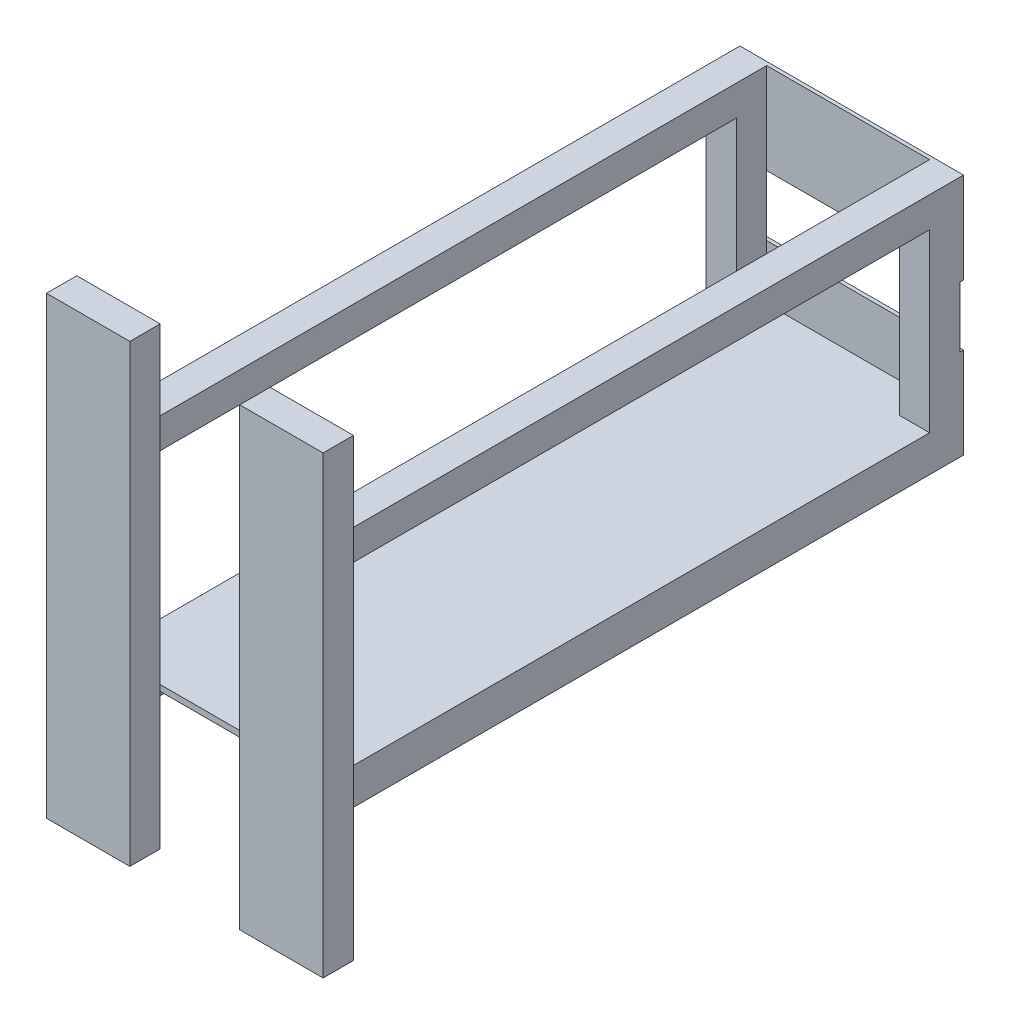
ISO-10303-21;
HEADER;
FILE_DESCRIPTION(('STEP AP214'),'2;1');
FILE_NAME('part.step','',(''),(''),'','','');
FILE_SCHEMA(('AUTOMOTIVE_DESIGN { 1 0 10303 214 1 1 1 1 }'));
ENDSEC;
DATA;
#1=APPLICATION_CONTEXT('core data for automotive mechanical design processes');
#2=APPLICATION_PROTOCOL_DEFINITION('international standard','automotive_design',2000,#1);
#3=PRODUCT_CONTEXT('',#1,'mechanical');
#4=PRODUCT('Part','Part','',(#3));
#5=PRODUCT_RELATED_PRODUCT_CATEGORY('part','',(#4));
#6=PRODUCT_DEFINITION_FORMATION('','',#4);
#7=PRODUCT_DEFINITION_CONTEXT('part definition',#1,'design');
#8=PRODUCT_DEFINITION('design','',#6,#7);
#9=PRODUCT_DEFINITION_SHAPE('','',#8);
#10=(LENGTH_UNIT() NAMED_UNIT(*) SI_UNIT(.MILLI.,.METRE.));
#11=(NAMED_UNIT(*) PLANE_ANGLE_UNIT() SI_UNIT($,.RADIAN.));
#12=(NAMED_UNIT(*) SI_UNIT($,.STERADIAN.) SOLID_ANGLE_UNIT());
#13=UNCERTAINTY_MEASURE_WITH_UNIT(LENGTH_MEASURE(1.E-05),#10,'distance_accuracy_value','');
#14=(GEOMETRIC_REPRESENTATION_CONTEXT(3) GLOBAL_UNCERTAINTY_ASSIGNED_CONTEXT((#13)) GLOBAL_UNIT_ASSIGNED_CONTEXT((#10,
#11,#12)) REPRESENTATION_CONTEXT('',''));
#15=CARTESIAN_POINT('',(0.,0.,0.));
#16=DIRECTION('',(0.,0.,1.));
#17=DIRECTION('',(1.,0.,0.));
#18=AXIS2_PLACEMENT_3D('',#15,#16,#17);
#19=CARTESIAN_POINT('',(0.,0.,6.));
#20=DIRECTION('',(0.,0.,-1.));
#21=DIRECTION('',(-1.,0.,0.));
#22=AXIS2_PLACEMENT_3D('',#19,#20,#21);
#23=PLANE('',#22);
#24=DIRECTION('',(-1.,0.,0.));
#25=VECTOR('',#24,1.);
#26=CARTESIAN_POINT('',(0.,254.,6.));
#27=LINE('',#26,#25);
#28=CARTESIAN_POINT('',(323.85,254.,6.));
#29=VERTEX_POINT('',#28);
#30=CARTESIAN_POINT('',(50.8,254.,6.));
#31=VERTEX_POINT('',#30);
#32=EDGE_CURVE('E401',#29,#31,#27,.T.);
#33=ORIENTED_EDGE('',*,*,#32,.F.);
#34=DIRECTION('',(0.,-1.,0.));
#35=VECTOR('',#34,1.);
#36=CARTESIAN_POINT('',(323.85,0.,6.));
#37=LINE('',#36,#35);
#38=CARTESIAN_POINT('',(323.85,406.4,6.00000000000001));
#39=VERTEX_POINT('',#38);
#40=EDGE_CURVE('E299',#39,#29,#37,.T.);
#41=ORIENTED_EDGE('',*,*,#40,.F.);
#42=DIRECTION('',(1.,0.,0.));
#43=VECTOR('',#42,1.);
#44=CARTESIAN_POINT('',(0.,406.4,6.));
#45=LINE('',#44,#43);
#46=CARTESIAN_POINT('',(50.8,406.4,6.00000000000001));
#47=VERTEX_POINT('',#46);
#48=EDGE_CURVE('E333',#47,#39,#45,.T.);
#49=ORIENTED_EDGE('',*,*,#48,.F.);
#50=DIRECTION('',(0.,-1.,0.));
#51=VECTOR('',#50,1.);
#52=CARTESIAN_POINT('',(50.8000000000001,0.,6.));
#53=LINE('',#52,#51);
#54=EDGE_CURVE('E290',#47,#31,#53,.T.);
#55=ORIENTED_EDGE('',*,*,#54,.T.);
#56=EDGE_LOOP('',(#33,#41,#49,#55));
#57=FACE_BOUND('',#56,.T.);
#58=ADVANCED_FACE('F36',(#57),#23,.F.);
#59=DIRECTION('',(0.,1.,0.));
#60=VECTOR('',#59,1.);
#61=CARTESIAN_POINT('',(323.85,-177.802,6.));
#62=LINE('',#61,#60);
#63=CARTESIAN_POINT('',(323.85,60.8,6.00000000000001));
#64=VERTEX_POINT('',#63);
#65=CARTESIAN_POINT('',(323.85,152.4,6.));
#66=VERTEX_POINT('',#65);
#67=EDGE_CURVE('E277',#64,#66,#62,.T.);
#68=ORIENTED_EDGE('',*,*,#67,.T.);
#69=DIRECTION('',(-1.,0.,0.));
#70=VECTOR('',#69,1.);
#71=CARTESIAN_POINT('',(0.,152.4,6.));
#72=LINE('',#71,#70);
#73=CARTESIAN_POINT('',(50.8,152.4,6.));
#74=VERTEX_POINT('',#73);
#75=EDGE_CURVE('E392',#66,#74,#72,.T.);
#76=ORIENTED_EDGE('',*,*,#75,.T.);
#77=DIRECTION('',(0.,1.,0.));
#78=VECTOR('',#77,1.);
#79=CARTESIAN_POINT('',(50.8,-177.802,6.));
#80=LINE('',#79,#78);
#81=CARTESIAN_POINT('',(50.8,60.8,6.00000000000001));
#82=VERTEX_POINT('',#81);
#83=EDGE_CURVE('E524',#82,#74,#80,.T.);
#84=ORIENTED_EDGE('',*,*,#83,.F.);
#85=DIRECTION('',(-1.,0.,0.));
#86=VECTOR('',#85,1.);
#87=CARTESIAN_POINT('',(0.,60.8,6.00000000000001));
#88=LINE('',#87,#86);
#89=EDGE_CURVE('E412',#64,#82,#88,.T.);
#90=ORIENTED_EDGE('',*,*,#89,.F.);
#91=EDGE_LOOP('',(#68,#76,#84,#90));
#92=FACE_BOUND('',#91,.T.);
#93=ADVANCED_FACE('F617',(#92),#23,.F.);
#94=CARTESIAN_POINT('',(0.,60.8,0.));
#95=DIRECTION('',(0.,1.,0.));
#96=DIRECTION('',(0.,0.,1.));
#97=AXIS2_PLACEMENT_3D('',#94,#95,#96);
#98=PLANE('',#97);
#99=DIRECTION('',(0.,0.,-1.));
#100=VECTOR('',#99,1.);
#101=CARTESIAN_POINT('',(374.65,60.8,6.00000000000001));
#102=LINE('',#101,#100);
#103=CARTESIAN_POINT('',(374.65,60.8,1066.8));
#104=VERTEX_POINT('',#103);
#105=CARTESIAN_POINT('',(374.65,60.8,56.8));
#106=VERTEX_POINT('',#105);
#107=EDGE_CURVE('E409',#104,#106,#102,.T.);
#108=ORIENTED_EDGE('',*,*,#107,.T.);
#109=DIRECTION('',(1.,0.,0.));
#110=VECTOR('',#109,1.);
#111=CARTESIAN_POINT('',(323.85,60.8,56.8));
#112=LINE('',#111,#110);
#113=CARTESIAN_POINT('',(323.85,60.8,56.8));
#114=VERTEX_POINT('',#113);
#115=EDGE_CURVE('E53',#114,#106,#112,.T.);
#116=ORIENTED_EDGE('',*,*,#115,.F.);
#117=DIRECTION('',(0.,0.,1.));
#118=VECTOR('',#117,1.);
#119=CARTESIAN_POINT('',(323.85,60.8,6.));
#120=LINE('',#119,#118);
#121=EDGE_CURVE('E57',#64,#114,#120,.T.);
#122=ORIENTED_EDGE('',*,*,#121,.F.);
#123=ORIENTED_EDGE('',*,*,#89,.T.);
#124=DIRECTION('',(0.,0.,-1.));
#125=VECTOR('',#124,1.);
#126=CARTESIAN_POINT('',(50.8,60.8,56.8));
#127=LINE('',#126,#125);
#128=CARTESIAN_POINT('',(50.8,60.8,56.8));
#129=VERTEX_POINT('',#128);
#130=EDGE_CURVE('E276',#129,#82,#127,.T.);
#131=ORIENTED_EDGE('',*,*,#130,.F.);
#132=DIRECTION('',(1.,0.,0.));
#133=VECTOR('',#132,1.);
#134=CARTESIAN_POINT('',(0.,60.8,56.8));
#135=LINE('',#134,#133);
#136=CARTESIAN_POINT('',(0.,60.8,56.8));
#137=VERTEX_POINT('',#136);
#138=EDGE_CURVE('E525',#137,#129,#135,.T.);
#139=ORIENTED_EDGE('',*,*,#138,.F.);
#140=DIRECTION('',(0.,0.,1.));
#141=VECTOR('',#140,1.);
#142=CARTESIAN_POINT('',(0.,60.8,6.00000000000001));
#143=LINE('',#142,#141);
#144=CARTESIAN_POINT('',(0.,60.8,1066.8));
#145=VERTEX_POINT('',#144);
#146=EDGE_CURVE('E402',#137,#145,#143,.T.);
#147=ORIENTED_EDGE('',*,*,#146,.T.);
#148=DIRECTION('',(1.,0.,0.));
#149=VECTOR('',#148,1.);
#150=CARTESIAN_POINT('',(0.,60.8,1066.8));
#151=LINE('',#150,#149);
#152=CARTESIAN_POINT('',(95.25,60.8,1066.8));
#153=VERTEX_POINT('',#152);
#154=EDGE_CURVE('E406',#145,#153,#151,.T.);
#155=ORIENTED_EDGE('',*,*,#154,.T.);
#156=CARTESIAN_POINT('',(279.4,60.8,1066.8));
#157=VERTEX_POINT('',#156);
#158=EDGE_CURVE('E410',#153,#157,#151,.T.);
#159=ORIENTED_EDGE('',*,*,#158,.T.);
#160=EDGE_CURVE('E404',#157,#104,#151,.T.);
#161=ORIENTED_EDGE('',*,*,#160,.T.);
#162=EDGE_LOOP('',(#108,#116,#122,#123,#131,#139,#147,#155,#159,#161));
#163=FACE_BOUND('',#162,.T.);
#164=ADVANCED_FACE('F547',(#163),#98,.T.);
#165=CARTESIAN_POINT('',(374.65,355.6,1066.8));
#166=DIRECTION('',(0.,-1.,0.));
#167=DIRECTION('',(0.,0.,-1.));
#168=AXIS2_PLACEMENT_3D('',#165,#166,#167);
#169=PLANE('',#168);
#170=DIRECTION('',(0.,0.,-1.));
#171=VECTOR('',#170,1.);
#172=CARTESIAN_POINT('',(323.85,355.6,1066.8));
#173=LINE('',#172,#171);
#174=CARTESIAN_POINT('',(323.85,355.6,1066.8));
#175=VERTEX_POINT('',#174);
#176=CARTESIAN_POINT('',(323.85,355.6,56.8));
#177=VERTEX_POINT('',#176);
#178=EDGE_CURVE('E275',#175,#177,#173,.T.);
#179=ORIENTED_EDGE('',*,*,#178,.T.);
#180=DIRECTION('',(-1.,0.,0.));
#181=VECTOR('',#180,1.);
#182=CARTESIAN_POINT('',(323.85,355.6,56.8));
#183=LINE('',#182,#181);
#184=CARTESIAN_POINT('',(374.65,355.6,56.8));
#185=VERTEX_POINT('',#184);
#186=EDGE_CURVE('E260',#185,#177,#183,.T.);
#187=ORIENTED_EDGE('',*,*,#186,.F.);
#188=DIRECTION('',(0.,0.,-1.));
#189=VECTOR('',#188,1.);
#190=CARTESIAN_POINT('',(374.65,355.6,1066.8));
#191=LINE('',#190,#189);
#192=CARTESIAN_POINT('',(374.65,355.6,1066.8));
#193=VERTEX_POINT('',#192);
#194=EDGE_CURVE('E272',#193,#185,#191,.T.);
#195=ORIENTED_EDGE('',*,*,#194,.F.);
#196=DIRECTION('',(-1.,0.,0.));
#197=VECTOR('',#196,1.);
#198=CARTESIAN_POINT('',(374.65,355.6,1066.8));
#199=LINE('',#198,#197);
#200=EDGE_CURVE('E296',#193,#175,#199,.T.);
#201=ORIENTED_EDGE('',*,*,#200,.T.);
#202=EDGE_LOOP('',(#179,#187,#195,#201));
#203=FACE_BOUND('',#202,.T.);
#204=ADVANCED_FACE('F270',(#203),#169,.T.);
#205=CARTESIAN_POINT('',(0.,355.6,1066.8));
#206=DIRECTION('',(0.,1.,0.));
#207=DIRECTION('',(0.,0.,1.));
#208=AXIS2_PLACEMENT_3D('',#205,#206,#207);
#209=PLANE('',#208);
#210=DIRECTION('',(-1.,0.,0.));
#211=VECTOR('',#210,1.);
#212=CARTESIAN_POINT('',(0.,355.6,56.8));
#213=LINE('',#212,#211);
#214=CARTESIAN_POINT('',(50.8,355.6,56.8));
#215=VERTEX_POINT('',#214);
#216=CARTESIAN_POINT('',(0.,355.6,56.8));
#217=VERTEX_POINT('',#216);
#218=EDGE_CURVE('E380',#215,#217,#213,.T.);
#219=ORIENTED_EDGE('',*,*,#218,.F.);
#220=DIRECTION('',(0.,0.,-1.));
#221=VECTOR('',#220,1.);
#222=CARTESIAN_POINT('',(50.8,355.6,1066.8));
#223=LINE('',#222,#221);
#224=CARTESIAN_POINT('',(50.8,355.6,1066.8));
#225=VERTEX_POINT('',#224);
#226=EDGE_CURVE('E494',#225,#215,#223,.T.);
#227=ORIENTED_EDGE('',*,*,#226,.F.);
#228=DIRECTION('',(1.,0.,0.));
#229=VECTOR('',#228,1.);
#230=CARTESIAN_POINT('',(0.,355.6,1066.8));
#231=LINE('',#230,#229);
#232=CARTESIAN_POINT('',(0.,355.6,1066.8));
#233=VERTEX_POINT('',#232);
#234=EDGE_CURVE('E500',#233,#225,#231,.T.);
#235=ORIENTED_EDGE('',*,*,#234,.F.);
#236=DIRECTION('',(0.,0.,-1.));
#237=VECTOR('',#236,1.);
#238=CARTESIAN_POINT('',(0.,355.6,1066.8));
#239=LINE('',#238,#237);
#240=EDGE_CURVE('E490',#233,#217,#239,.T.);
#241=ORIENTED_EDGE('',*,*,#240,.T.);
#242=EDGE_LOOP('',(#219,#227,#235,#241));
#243=FACE_BOUND('',#242,.T.);
#244=ADVANCED_FACE('F543',(#243),#209,.F.);
#245=CARTESIAN_POINT('',(0.,0.,0.));
#246=DIRECTION('',(0.,0.,-1.));
#247=DIRECTION('',(-1.,0.,0.));
#248=AXIS2_PLACEMENT_3D('',#245,#246,#247);
#249=PLANE('',#248);
#250=DIRECTION('',(0.,1.,0.));
#251=VECTOR('',#250,1.);
#252=CARTESIAN_POINT('',(374.65,0.,0.));
#253=LINE('',#252,#251);
#254=CARTESIAN_POINT('',(374.65,254.,0.));
#255=VERTEX_POINT('',#254);
#256=CARTESIAN_POINT('',(374.65,406.4,0.));
#257=VERTEX_POINT('',#256);
#258=EDGE_CURVE('E345',#255,#257,#253,.T.);
#259=ORIENTED_EDGE('',*,*,#258,.F.);
#260=DIRECTION('',(-1.,0.,0.));
#261=VECTOR('',#260,1.);
#262=CARTESIAN_POINT('',(374.65,254.,0.));
#263=LINE('',#262,#261);
#264=CARTESIAN_POINT('',(0.,254.,0.));
#265=VERTEX_POINT('',#264);
#266=EDGE_CURVE('E370',#255,#265,#263,.T.);
#267=ORIENTED_EDGE('',*,*,#266,.T.);
#268=DIRECTION('',(0.,1.,0.));
#269=VECTOR('',#268,1.);
#270=CARTESIAN_POINT('',(0.,0.,0.));
#271=LINE('',#270,#269);
#272=CARTESIAN_POINT('',(0.,406.4,0.));
#273=VERTEX_POINT('',#272);
#274=EDGE_CURVE('E332',#265,#273,#271,.T.);
#275=ORIENTED_EDGE('',*,*,#274,.T.);
#276=DIRECTION('',(1.,0.,0.));
#277=VECTOR('',#276,1.);
#278=CARTESIAN_POINT('',(0.,406.4,0.));
#279=LINE('',#278,#277);
#280=EDGE_CURVE('E342',#273,#257,#279,.T.);
#281=ORIENTED_EDGE('',*,*,#280,.T.);
#282=EDGE_LOOP('',(#259,#267,#275,#281));
#283=FACE_BOUND('',#282,.T.);
#284=ADVANCED_FACE('F368',(#283),#249,.T.);
#285=DIRECTION('',(-1.,0.,0.));
#286=VECTOR('',#285,1.);
#287=CARTESIAN_POINT('',(0.,50.8,6.00000000000001));
#288=LINE('',#287,#286);
#289=CARTESIAN_POINT('',(323.85,50.8,6.));
#290=VERTEX_POINT('',#289);
#291=CARTESIAN_POINT('',(50.8,50.8,6.));
#292=VERTEX_POINT('',#291);
#293=EDGE_CURVE('E405',#290,#292,#288,.T.);
#294=ORIENTED_EDGE('',*,*,#293,.T.);
#295=DIRECTION('',(0.,1.,0.));
#296=VECTOR('',#295,1.);
#297=CARTESIAN_POINT('',(50.8,0.,6.));
#298=LINE('',#297,#296);
#299=CARTESIAN_POINT('',(50.8,0.,6.00000000000001));
#300=VERTEX_POINT('',#299);
#301=EDGE_CURVE('E327',#300,#292,#298,.T.);
#302=ORIENTED_EDGE('',*,*,#301,.F.);
#303=DIRECTION('',(1.,0.,0.));
#304=VECTOR('',#303,1.);
#305=CARTESIAN_POINT('',(0.,0.,6.));
#306=LINE('',#305,#304);
#307=CARTESIAN_POINT('',(323.85,0.,6.00000000000001));
#308=VERTEX_POINT('',#307);
#309=EDGE_CURVE('E335',#300,#308,#306,.T.);
#310=ORIENTED_EDGE('',*,*,#309,.T.);
#311=DIRECTION('',(0.,1.,0.));
#312=VECTOR('',#311,1.);
#313=CARTESIAN_POINT('',(323.85,0.,6.));
#314=LINE('',#313,#312);
#315=EDGE_CURVE('E314',#308,#290,#314,.T.);
#316=ORIENTED_EDGE('',*,*,#315,.T.);
#317=EDGE_LOOP('',(#294,#302,#310,#316));
#318=FACE_BOUND('',#317,.T.);
#319=ADVANCED_FACE('F554',(#318),#23,.F.);
#320=CARTESIAN_POINT('',(0.,0.,1066.8));
#321=DIRECTION('',(0.,0.,1.));
#322=DIRECTION('',(1.,0.,0.));
#323=AXIS2_PLACEMENT_3D('',#320,#321,#322);
#324=PLANE('',#323);
#325=DIRECTION('',(0.,-1.,0.));
#326=VECTOR('',#325,1.);
#327=CARTESIAN_POINT('',(0.,406.4,1066.8));
#328=LINE('',#327,#326);
#329=CARTESIAN_POINT('',(0.,406.4,1066.8));
#330=VERTEX_POINT('',#329);
#331=EDGE_CURVE('E363',#330,#233,#328,.T.);
#332=ORIENTED_EDGE('',*,*,#331,.T.);
#333=ORIENTED_EDGE('',*,*,#234,.T.);
#334=DIRECTION('',(0.,-1.,0.));
#335=VECTOR('',#334,1.);
#336=CARTESIAN_POINT('',(50.8,406.4,1066.8));
#337=LINE('',#336,#335);
#338=CARTESIAN_POINT('',(50.8,406.4,1066.8));
#339=VERTEX_POINT('',#338);
#340=EDGE_CURVE('E502',#339,#225,#337,.T.);
#341=ORIENTED_EDGE('',*,*,#340,.F.);
#342=DIRECTION('',(1.,0.,0.));
#343=VECTOR('',#342,1.);
#344=CARTESIAN_POINT('',(0.,406.4,1066.8));
#345=LINE('',#344,#343);
#346=EDGE_CURVE('E504',#330,#339,#345,.T.);
#347=ORIENTED_EDGE('',*,*,#346,.F.);
#348=EDGE_LOOP('',(#332,#333,#341,#347));
#349=FACE_BOUND('',#348,.T.);
#350=ORIENTED_EDGE('',*,*,#154,.F.);
#351=DIRECTION('',(0.,1.,0.));
#352=VECTOR('',#351,1.);
#353=CARTESIAN_POINT('',(0.,0.,1066.8));
#354=LINE('',#353,#352);
#355=CARTESIAN_POINT('',(0.,0.,1066.8));
#356=VERTEX_POINT('',#355);
#357=EDGE_CURVE('E317',#356,#145,#354,.T.);
#358=ORIENTED_EDGE('',*,*,#357,.F.);
#359=DIRECTION('',(1.,0.,0.));
#360=VECTOR('',#359,1.);
#361=CARTESIAN_POINT('',(0.,0.,1066.8));
#362=LINE('',#361,#360);
#363=CARTESIAN_POINT('',(50.8,0.,1066.8));
#364=VERTEX_POINT('',#363);
#365=EDGE_CURVE('E322',#356,#364,#362,.T.);
#366=ORIENTED_EDGE('',*,*,#365,.T.);
#367=DIRECTION('',(0.,1.,0.));
#368=VECTOR('',#367,1.);
#369=CARTESIAN_POINT('',(50.8,0.,1066.8));
#370=LINE('',#369,#368);
#371=CARTESIAN_POINT('',(50.8,50.8,1066.8));
#372=VERTEX_POINT('',#371);
#373=EDGE_CURVE('E320',#364,#372,#370,.T.);
#374=ORIENTED_EDGE('',*,*,#373,.T.);
#375=DIRECTION('',(1.,0.,0.));
#376=VECTOR('',#375,1.);
#377=CARTESIAN_POINT('',(0.,50.8,1066.8));
#378=LINE('',#377,#376);
#379=CARTESIAN_POINT('',(95.25,50.8,1066.8));
#380=VERTEX_POINT('',#379);
#381=EDGE_CURVE('E417',#372,#380,#378,.T.);
#382=ORIENTED_EDGE('',*,*,#381,.T.);
#383=DIRECTION('',(0.,1.,0.));
#384=VECTOR('',#383,1.);
#385=CARTESIAN_POINT('',(95.25,-177.8,1066.8));
#386=LINE('',#385,#384);
#387=CARTESIAN_POINT('',(95.25,-177.8,1066.8));
#388=VERTEX_POINT('',#387);
#389=EDGE_CURVE('E473',#388,#380,#386,.T.);
#390=ORIENTED_EDGE('',*,*,#389,.F.);
#391=DIRECTION('',(1.,0.,0.));
#392=VECTOR('',#391,1.);
#393=CARTESIAN_POINT('',(-44.45,-177.8,1066.8));
#394=LINE('',#393,#392);
#395=CARTESIAN_POINT('',(-44.45,-177.8,1066.8));
#396=VERTEX_POINT('',#395);
#397=EDGE_CURVE('E446',#396,#388,#394,.T.);
#398=ORIENTED_EDGE('',*,*,#397,.F.);
#399=DIRECTION('',(0.,1.,0.));
#400=VECTOR('',#399,1.);
#401=CARTESIAN_POINT('',(-44.45,-177.8,1066.8));
#402=LINE('',#401,#400);
#403=CARTESIAN_POINT('',(-44.45,584.2,1066.8));
#404=VERTEX_POINT('',#403);
#405=EDGE_CURVE('E461',#396,#404,#402,.T.);
#406=ORIENTED_EDGE('',*,*,#405,.T.);
#407=DIRECTION('',(1.,0.,0.));
#408=VECTOR('',#407,1.);
#409=CARTESIAN_POINT('',(-44.45,584.2,1066.8));
#410=LINE('',#409,#408);
#411=CARTESIAN_POINT('',(95.25,584.2,1066.8));
#412=VERTEX_POINT('',#411);
#413=EDGE_CURVE('E476',#404,#412,#410,.T.);
#414=ORIENTED_EDGE('',*,*,#413,.T.);
#415=EDGE_CURVE('E472',#153,#412,#386,.T.);
#416=ORIENTED_EDGE('',*,*,#415,.F.);
#417=EDGE_LOOP('',(#350,#358,#366,#374,#382,#390,#398,#406,#414,#416));
#418=FACE_BOUND('',#417,.T.);
#419=ADVANCED_FACE('F550',(#349,#418),#324,.F.);
#420=CARTESIAN_POINT('',(0.,0.,1066.8));
#421=DIRECTION('',(0.,0.,1.));
#422=DIRECTION('',(1.,0.,0.));
#423=AXIS2_PLACEMENT_3D('',#420,#421,#422);
#424=PLANE('',#423);
#425=ORIENTED_EDGE('',*,*,#200,.F.);
#426=DIRECTION('',(0.,-1.,0.));
#427=VECTOR('',#426,1.);
#428=CARTESIAN_POINT('',(374.65,406.4,1066.8));
#429=LINE('',#428,#427);
#430=CARTESIAN_POINT('',(374.65,406.4,1066.8));
#431=VERTEX_POINT('',#430);
#432=EDGE_CURVE('E282',#431,#193,#429,.T.);
#433=ORIENTED_EDGE('',*,*,#432,.F.);
#434=DIRECTION('',(-1.,0.,0.));
#435=VECTOR('',#434,1.);
#436=CARTESIAN_POINT('',(374.65,406.4,1066.8));
#437=LINE('',#436,#435);
#438=CARTESIAN_POINT('',(323.85,406.4,1066.8));
#439=VERTEX_POINT('',#438);
#440=EDGE_CURVE('E283',#431,#439,#437,.T.);
#441=ORIENTED_EDGE('',*,*,#440,.T.);
#442=DIRECTION('',(0.,-1.,0.));
#443=VECTOR('',#442,1.);
#444=CARTESIAN_POINT('',(323.85,406.4,1066.8));
#445=LINE('',#444,#443);
#446=EDGE_CURVE('E285',#439,#175,#445,.T.);
#447=ORIENTED_EDGE('',*,*,#446,.T.);
#448=EDGE_LOOP('',(#425,#433,#441,#447));
#449=FACE_BOUND('',#448,.T.);
#450=DIRECTION('',(0.,1.,0.));
#451=VECTOR('',#450,1.);
#452=CARTESIAN_POINT('',(374.65,0.,1066.8));
#453=LINE('',#452,#451);
#454=CARTESIAN_POINT('',(374.65,0.,1066.8));
#455=VERTEX_POINT('',#454);
#456=EDGE_CURVE('E305',#455,#104,#453,.T.);
#457=ORIENTED_EDGE('',*,*,#456,.T.);
#458=ORIENTED_EDGE('',*,*,#160,.F.);
#459=DIRECTION('',(0.,1.,0.));
#460=VECTOR('',#459,1.);
#461=CARTESIAN_POINT('',(279.4,-177.8,1066.8));
#462=LINE('',#461,#460);
#463=CARTESIAN_POINT('',(279.4,584.2,1066.8));
#464=VERTEX_POINT('',#463);
#465=EDGE_CURVE('E437',#157,#464,#462,.T.);
#466=ORIENTED_EDGE('',*,*,#465,.T.);
#467=DIRECTION('',(1.,0.,0.));
#468=VECTOR('',#467,1.);
#469=CARTESIAN_POINT('',(279.4,584.2,1066.8));
#470=LINE('',#469,#468);
#471=CARTESIAN_POINT('',(419.1,584.2,1066.8));
#472=VERTEX_POINT('',#471);
#473=EDGE_CURVE('E435',#464,#472,#470,.T.);
#474=ORIENTED_EDGE('',*,*,#473,.T.);
#475=DIRECTION('',(0.,1.,0.));
#476=VECTOR('',#475,1.);
#477=CARTESIAN_POINT('',(419.1,-177.8,1066.8));
#478=LINE('',#477,#476);
#479=CARTESIAN_POINT('',(419.1,-177.8,1066.8));
#480=VERTEX_POINT('',#479);
#481=EDGE_CURVE('E440',#480,#472,#478,.T.);
#482=ORIENTED_EDGE('',*,*,#481,.F.);
#483=DIRECTION('',(1.,0.,0.));
#484=VECTOR('',#483,1.);
#485=CARTESIAN_POINT('',(279.4,-177.8,1066.8));
#486=LINE('',#485,#484);
#487=CARTESIAN_POINT('',(279.4,-177.8,1066.8));
#488=VERTEX_POINT('',#487);
#489=EDGE_CURVE('E443',#488,#480,#486,.T.);
#490=ORIENTED_EDGE('',*,*,#489,.F.);
#491=CARTESIAN_POINT('',(279.4,50.8,1066.8));
#492=VERTEX_POINT('',#491);
#493=EDGE_CURVE('E432',#488,#492,#462,.T.);
#494=ORIENTED_EDGE('',*,*,#493,.T.);
#495=CARTESIAN_POINT('',(323.85,50.8,1066.8));
#496=VERTEX_POINT('',#495);
#497=EDGE_CURVE('E400',#492,#496,#378,.T.);
#498=ORIENTED_EDGE('',*,*,#497,.T.);
#499=DIRECTION('',(0.,1.,0.));
#500=VECTOR('',#499,1.);
#501=CARTESIAN_POINT('',(323.85,0.,1066.8));
#502=LINE('',#501,#500);
#503=CARTESIAN_POINT('',(323.85,0.,1066.8));
#504=VERTEX_POINT('',#503);
#505=EDGE_CURVE('E308',#504,#496,#502,.T.);
#506=ORIENTED_EDGE('',*,*,#505,.F.);
#507=DIRECTION('',(-1.,0.,0.));
#508=VECTOR('',#507,1.);
#509=CARTESIAN_POINT('',(374.65,0.,1066.8));
#510=LINE('',#509,#508);
#511=EDGE_CURVE('E311',#455,#504,#510,.T.);
#512=ORIENTED_EDGE('',*,*,#511,.F.);
#513=EDGE_LOOP('',(#457,#458,#466,#474,#482,#490,#494,#498,#506,#512));
#514=FACE_BOUND('',#513,.T.);
#515=ADVANCED_FACE('F553',(#449,#514),#424,.F.);
#516=CARTESIAN_POINT('',(0.,0.,6.));
#517=DIRECTION('',(-1.,0.,0.));
#518=DIRECTION('',(0.,0.,1.));
#519=AXIS2_PLACEMENT_3D('',#516,#517,#518);
#520=PLANE('',#519);
#521=DIRECTION('',(0.,1.,0.));
#522=VECTOR('',#521,1.);
#523=CARTESIAN_POINT('',(0.,-177.802,6.00000000000001));
#524=LINE('',#523,#522);
#525=CARTESIAN_POINT('',(0.,152.4,6.00000000000001));
#526=VERTEX_POINT('',#525);
#527=CARTESIAN_POINT('',(0.,254.,6.));
#528=VERTEX_POINT('',#527);
#529=EDGE_CURVE('E520',#526,#528,#524,.T.);
#530=ORIENTED_EDGE('',*,*,#529,.F.);
#531=DIRECTION('',(0.,0.,-1.));
#532=VECTOR('',#531,1.);
#533=CARTESIAN_POINT('',(0.,152.4,10.));
#534=LINE('',#533,#532);
#535=CARTESIAN_POINT('',(0.,152.4,0.));
#536=VERTEX_POINT('',#535);
#537=EDGE_CURVE('E385',#526,#536,#534,.T.);
#538=ORIENTED_EDGE('',*,*,#537,.T.);
#539=CARTESIAN_POINT('',(0.,0.,0.));
#540=VERTEX_POINT('',#539);
#541=EDGE_CURVE('E339',#540,#536,#271,.T.);
#542=ORIENTED_EDGE('',*,*,#541,.F.);
#543=DIRECTION('',(0.,0.,-1.));
#544=VECTOR('',#543,1.);
#545=CARTESIAN_POINT('',(0.,0.,6.));
#546=LINE('',#545,#544);
#547=EDGE_CURVE('E11',#356,#540,#546,.T.);
#548=ORIENTED_EDGE('',*,*,#547,.F.);
#549=ORIENTED_EDGE('',*,*,#357,.T.);
#550=ORIENTED_EDGE('',*,*,#146,.F.);
#551=DIRECTION('',(0.,1.,0.));
#552=VECTOR('',#551,1.);
#553=CARTESIAN_POINT('',(0.,-177.802,56.8));
#554=LINE('',#553,#552);
#555=EDGE_CURVE('E533',#137,#217,#554,.T.);
#556=ORIENTED_EDGE('',*,*,#555,.T.);
#557=ORIENTED_EDGE('',*,*,#240,.F.);
#558=ORIENTED_EDGE('',*,*,#331,.F.);
#559=DIRECTION('',(0.,0.,-1.));
#560=VECTOR('',#559,1.);
#561=CARTESIAN_POINT('',(0.,406.4,6.));
#562=LINE('',#561,#560);
#563=EDGE_CURVE('E40',#330,#273,#562,.T.);
#564=ORIENTED_EDGE('',*,*,#563,.T.);
#565=ORIENTED_EDGE('',*,*,#274,.F.);
#566=DIRECTION('',(0.,0.,-1.));
#567=VECTOR('',#566,1.);
#568=CARTESIAN_POINT('',(0.,254.,10.));
#569=LINE('',#568,#567);
#570=EDGE_CURVE('E388',#528,#265,#569,.T.);
#571=ORIENTED_EDGE('',*,*,#570,.F.);
#572=EDGE_LOOP('',(#530,#538,#542,#548,#549,#550,#556,#557,#558,#564,#565,#571));
#573=FACE_BOUND('',#572,.T.);
#574=ADVANCED_FACE('F38',(#573),#520,.T.);
#575=CARTESIAN_POINT('',(0.,0.,6.));
#576=DIRECTION('',(0.,1.,0.));
#577=DIRECTION('',(0.,0.,1.));
#578=AXIS2_PLACEMENT_3D('',#575,#576,#577);
#579=PLANE('',#578);
#580=DIRECTION('',(1.,0.,0.));
#581=VECTOR('',#580,1.);
#582=CARTESIAN_POINT('',(0.,0.,0.));
#583=LINE('',#582,#581);
#584=CARTESIAN_POINT('',(374.65,0.,0.));
#585=VERTEX_POINT('',#584);
#586=EDGE_CURVE('E336',#540,#585,#583,.T.);
#587=ORIENTED_EDGE('',*,*,#586,.T.);
#588=DIRECTION('',(0.,0.,-1.));
#589=VECTOR('',#588,1.);
#590=CARTESIAN_POINT('',(374.65,0.,6.));
#591=LINE('',#590,#589);
#592=EDGE_CURVE('E45',#455,#585,#591,.T.);
#593=ORIENTED_EDGE('',*,*,#592,.F.);
#594=ORIENTED_EDGE('',*,*,#511,.T.);
#595=DIRECTION('',(0.,0.,-1.));
#596=VECTOR('',#595,1.);
#597=CARTESIAN_POINT('',(323.85,0.,1066.8));
#598=LINE('',#597,#596);
#599=EDGE_CURVE('E302',#504,#308,#598,.T.);
#600=ORIENTED_EDGE('',*,*,#599,.T.);
#601=ORIENTED_EDGE('',*,*,#309,.F.);
#602=DIRECTION('',(0.,0.,-1.));
#603=VECTOR('',#602,1.);
#604=CARTESIAN_POINT('',(50.8,0.,1066.8));
#605=LINE('',#604,#603);
#606=EDGE_CURVE('E325',#364,#300,#605,.T.);
#607=ORIENTED_EDGE('',*,*,#606,.F.);
#608=ORIENTED_EDGE('',*,*,#365,.F.);
#609=ORIENTED_EDGE('',*,*,#547,.T.);
#610=EDGE_LOOP('',(#587,#593,#594,#600,#601,#607,#608,#609));
#611=FACE_BOUND('',#610,.T.);
#612=ADVANCED_FACE('F575',(#611),#579,.F.);
#613=CARTESIAN_POINT('',(374.65,0.,6.));
#614=DIRECTION('',(-1.,0.,0.));
#615=DIRECTION('',(0.,0.,1.));
#616=AXIS2_PLACEMENT_3D('',#613,#614,#615);
#617=PLANE('',#616);
#618=CARTESIAN_POINT('',(374.65,152.4,0.));
#619=VERTEX_POINT('',#618);
#620=EDGE_CURVE('E346',#585,#619,#253,.T.);
#621=ORIENTED_EDGE('',*,*,#620,.T.);
#622=DIRECTION('',(0.,0.,-1.));
#623=VECTOR('',#622,1.);
#624=CARTESIAN_POINT('',(374.65,152.4,10.));
#625=LINE('',#624,#623);
#626=CARTESIAN_POINT('',(374.65,152.4,6.));
#627=VERTEX_POINT('',#626);
#628=EDGE_CURVE('E377',#627,#619,#625,.T.);
#629=ORIENTED_EDGE('',*,*,#628,.F.);
#630=DIRECTION('',(0.,1.,0.));
#631=VECTOR('',#630,1.);
#632=CARTESIAN_POINT('',(374.65,-177.802,6.00000000000001));
#633=LINE('',#632,#631);
#634=CARTESIAN_POINT('',(374.65,254.,6.00000000000001));
#635=VERTEX_POINT('',#634);
#636=EDGE_CURVE('E266',#627,#635,#633,.T.);
#637=ORIENTED_EDGE('',*,*,#636,.T.);
#638=DIRECTION('',(0.,0.,-1.));
#639=VECTOR('',#638,1.);
#640=CARTESIAN_POINT('',(374.65,254.,10.));
#641=LINE('',#640,#639);
#642=EDGE_CURVE('E390',#635,#255,#641,.T.);
#643=ORIENTED_EDGE('',*,*,#642,.T.);
#644=ORIENTED_EDGE('',*,*,#258,.T.);
#645=DIRECTION('',(0.,0.,-1.));
#646=VECTOR('',#645,1.);
#647=CARTESIAN_POINT('',(374.65,406.4,6.));
#648=LINE('',#647,#646);
#649=EDGE_CURVE('E350',#431,#257,#648,.T.);
#650=ORIENTED_EDGE('',*,*,#649,.F.);
#651=ORIENTED_EDGE('',*,*,#432,.T.);
#652=ORIENTED_EDGE('',*,*,#194,.T.);
#653=DIRECTION('',(0.,1.,0.));
#654=VECTOR('',#653,1.);
#655=CARTESIAN_POINT('',(374.65,-177.802,56.8));
#656=LINE('',#655,#654);
#657=EDGE_CURVE('E256',#106,#185,#656,.T.);
#658=ORIENTED_EDGE('',*,*,#657,.F.);
#659=ORIENTED_EDGE('',*,*,#107,.F.);
#660=ORIENTED_EDGE('',*,*,#456,.F.);
#661=ORIENTED_EDGE('',*,*,#592,.T.);
#662=EDGE_LOOP('',(#621,#629,#637,#643,#644,#650,#651,#652,#658,#659,#660,#661));
#663=FACE_BOUND('',#662,.T.);
#664=ADVANCED_FACE('F280',(#663),#617,.F.);
#665=CARTESIAN_POINT('',(0.,406.4,6.));
#666=DIRECTION('',(0.,1.,0.));
#667=DIRECTION('',(0.,0.,1.));
#668=AXIS2_PLACEMENT_3D('',#665,#666,#667);
#669=PLANE('',#668);
#670=ORIENTED_EDGE('',*,*,#649,.T.);
#671=ORIENTED_EDGE('',*,*,#280,.F.);
#672=ORIENTED_EDGE('',*,*,#563,.F.);
#673=ORIENTED_EDGE('',*,*,#346,.T.);
#674=DIRECTION('',(0.,0.,-1.));
#675=VECTOR('',#674,1.);
#676=CARTESIAN_POINT('',(50.8,406.4,1066.8));
#677=LINE('',#676,#675);
#678=EDGE_CURVE('E491',#339,#47,#677,.T.);
#679=ORIENTED_EDGE('',*,*,#678,.T.);
#680=ORIENTED_EDGE('',*,*,#48,.T.);
#681=DIRECTION('',(0.,0.,-1.));
#682=VECTOR('',#681,1.);
#683=CARTESIAN_POINT('',(323.85,406.4,1066.8));
#684=LINE('',#683,#682);
#685=EDGE_CURVE('E287',#439,#39,#684,.T.);
#686=ORIENTED_EDGE('',*,*,#685,.F.);
#687=ORIENTED_EDGE('',*,*,#440,.F.);
#688=EDGE_LOOP('',(#670,#671,#672,#673,#679,#680,#686,#687));
#689=FACE_BOUND('',#688,.T.);
#690=ADVANCED_FACE('F365',(#689),#669,.T.);
#691=DIRECTION('',(-1.,0.,0.));
#692=VECTOR('',#691,1.);
#693=CARTESIAN_POINT('',(374.65,152.4,0.));
#694=LINE('',#693,#692);
#695=EDGE_CURVE('E374',#619,#536,#694,.T.);
#696=ORIENTED_EDGE('',*,*,#695,.F.);
#697=ORIENTED_EDGE('',*,*,#620,.F.);
#698=ORIENTED_EDGE('',*,*,#586,.F.);
#699=ORIENTED_EDGE('',*,*,#541,.T.);
#700=EDGE_LOOP('',(#696,#697,#698,#699));
#701=FACE_BOUND('',#700,.T.);
#702=ADVANCED_FACE('F581',(#701),#249,.T.);
#703=CARTESIAN_POINT('',(50.8,0.,1066.8));
#704=DIRECTION('',(-1.,0.,0.));
#705=DIRECTION('',(0.,0.,1.));
#706=AXIS2_PLACEMENT_3D('',#703,#704,#705);
#707=PLANE('',#706);
#708=ORIENTED_EDGE('',*,*,#606,.T.);
#709=ORIENTED_EDGE('',*,*,#301,.T.);
#710=DIRECTION('',(0.,0.,-1.));
#711=VECTOR('',#710,1.);
#712=CARTESIAN_POINT('',(50.8,50.8,1066.8));
#713=LINE('',#712,#711);
#714=EDGE_CURVE('E324',#372,#292,#713,.T.);
#715=ORIENTED_EDGE('',*,*,#714,.F.);
#716=ORIENTED_EDGE('',*,*,#373,.F.);
#717=EDGE_LOOP('',(#708,#709,#715,#716));
#718=FACE_BOUND('',#717,.T.);
#719=ADVANCED_FACE('F636',(#718),#707,.F.);
#720=CARTESIAN_POINT('',(323.85,0.,1066.8));
#721=DIRECTION('',(-1.,0.,0.));
#722=DIRECTION('',(0.,0.,1.));
#723=AXIS2_PLACEMENT_3D('',#720,#721,#722);
#724=PLANE('',#723);
#725=ORIENTED_EDGE('',*,*,#315,.F.);
#726=ORIENTED_EDGE('',*,*,#599,.F.);
#727=ORIENTED_EDGE('',*,*,#505,.T.);
#728=DIRECTION('',(0.,0.,-1.));
#729=VECTOR('',#728,1.);
#730=CARTESIAN_POINT('',(323.85,50.8,1066.8));
#731=LINE('',#730,#729);
#732=EDGE_CURVE('E301',#496,#290,#731,.T.);
#733=ORIENTED_EDGE('',*,*,#732,.T.);
#734=EDGE_LOOP('',(#725,#726,#727,#733));
#735=FACE_BOUND('',#734,.T.);
#736=ADVANCED_FACE('F644',(#735),#724,.T.);
#737=CARTESIAN_POINT('',(323.85,406.4,1066.8));
#738=DIRECTION('',(1.,0.,0.));
#739=DIRECTION('',(0.,0.,-1.));
#740=AXIS2_PLACEMENT_3D('',#737,#738,#739);
#741=PLANE('',#740);
#742=ORIENTED_EDGE('',*,*,#685,.T.);
#743=ORIENTED_EDGE('',*,*,#40,.T.);
#744=EDGE_CURVE('E596',#66,#29,#62,.T.);
#745=ORIENTED_EDGE('',*,*,#744,.F.);
#746=ORIENTED_EDGE('',*,*,#67,.F.);
#747=ORIENTED_EDGE('',*,*,#121,.T.);
#748=DIRECTION('',(0.,1.,0.));
#749=VECTOR('',#748,1.);
#750=CARTESIAN_POINT('',(323.85,-177.802,56.8));
#751=LINE('',#750,#749);
#752=EDGE_CURVE('E265',#114,#177,#751,.T.);
#753=ORIENTED_EDGE('',*,*,#752,.T.);
#754=ORIENTED_EDGE('',*,*,#178,.F.);
#755=ORIENTED_EDGE('',*,*,#446,.F.);
#756=EDGE_LOOP('',(#742,#743,#745,#746,#747,#753,#754,#755));
#757=FACE_BOUND('',#756,.T.);
#758=ADVANCED_FACE('F602',(#757),#741,.F.);
#759=CARTESIAN_POINT('',(50.8,406.4,1066.8));
#760=DIRECTION('',(1.,0.,0.));
#761=DIRECTION('',(0.,1.,0.));
#762=AXIS2_PLACEMENT_3D('',#759,#760,#761);
#763=PLANE('',#762);
#764=ORIENTED_EDGE('',*,*,#54,.F.);
#765=ORIENTED_EDGE('',*,*,#678,.F.);
#766=ORIENTED_EDGE('',*,*,#340,.T.);
#767=ORIENTED_EDGE('',*,*,#226,.T.);
#768=DIRECTION('',(0.,1.,0.));
#769=VECTOR('',#768,1.);
#770=CARTESIAN_POINT('',(50.8,-177.802,56.8));
#771=LINE('',#770,#769);
#772=EDGE_CURVE('E527',#129,#215,#771,.T.);
#773=ORIENTED_EDGE('',*,*,#772,.F.);
#774=ORIENTED_EDGE('',*,*,#130,.T.);
#775=ORIENTED_EDGE('',*,*,#83,.T.);
#776=EDGE_CURVE('E518',#74,#31,#80,.T.);
#777=ORIENTED_EDGE('',*,*,#776,.T.);
#778=EDGE_LOOP('',(#764,#765,#766,#767,#773,#774,#775,#777));
#779=FACE_BOUND('',#778,.T.);
#780=ADVANCED_FACE('F521',(#779),#763,.T.);
#781=CARTESIAN_POINT('',(-44.45,-177.8,1117.6));
#782=DIRECTION('',(0.,1.,0.));
#783=DIRECTION('',(0.,0.,1.));
#784=AXIS2_PLACEMENT_3D('',#781,#782,#783);
#785=PLANE('',#784);
#786=ORIENTED_EDGE('',*,*,#397,.T.);
#787=DIRECTION('',(0.,0.,-1.));
#788=VECTOR('',#787,1.);
#789=CARTESIAN_POINT('',(95.25,-177.8,1117.6));
#790=LINE('',#789,#788);
#791=CARTESIAN_POINT('',(95.25,-177.8,1117.6));
#792=VERTEX_POINT('',#791);
#793=EDGE_CURVE('E487',#792,#388,#790,.T.);
#794=ORIENTED_EDGE('',*,*,#793,.F.);
#795=DIRECTION('',(1.,0.,0.));
#796=VECTOR('',#795,1.);
#797=CARTESIAN_POINT('',(-44.45,-177.8,1117.6));
#798=LINE('',#797,#796);
#799=CARTESIAN_POINT('',(-44.45,-177.8,1117.6));
#800=VERTEX_POINT('',#799);
#801=EDGE_CURVE('E457',#800,#792,#798,.T.);
#802=ORIENTED_EDGE('',*,*,#801,.F.);
#803=DIRECTION('',(0.,0.,-1.));
#804=VECTOR('',#803,1.);
#805=CARTESIAN_POINT('',(-44.45,-177.8,1117.6));
#806=LINE('',#805,#804);
#807=EDGE_CURVE('E469',#800,#396,#806,.T.);
#808=ORIENTED_EDGE('',*,*,#807,.T.);
#809=EDGE_LOOP('',(#786,#794,#802,#808));
#810=FACE_BOUND('',#809,.T.);
#811=ADVANCED_FACE('F687',(#810),#785,.F.);
#812=CARTESIAN_POINT('',(95.25,-177.8,1117.6));
#813=DIRECTION('',(-1.,0.,0.));
#814=DIRECTION('',(0.,0.,1.));
#815=AXIS2_PLACEMENT_3D('',#812,#813,#814);
#816=PLANE('',#815);
#817=ORIENTED_EDGE('',*,*,#389,.T.);
#818=DIRECTION('',(0.,-1.,0.));
#819=VECTOR('',#818,1.);
#820=CARTESIAN_POINT('',(95.25,-177.8,1066.8));
#821=LINE('',#820,#819);
#822=EDGE_CURVE('E414',#153,#380,#821,.T.);
#823=ORIENTED_EDGE('',*,*,#822,.F.);
#824=ORIENTED_EDGE('',*,*,#415,.T.);
#825=DIRECTION('',(0.,0.,-1.));
#826=VECTOR('',#825,1.);
#827=CARTESIAN_POINT('',(95.25,584.2,1117.6));
#828=LINE('',#827,#826);
#829=CARTESIAN_POINT('',(95.25,584.2,1117.6));
#830=VERTEX_POINT('',#829);
#831=EDGE_CURVE('E484',#830,#412,#828,.T.);
#832=ORIENTED_EDGE('',*,*,#831,.F.);
#833=DIRECTION('',(0.,1.,0.));
#834=VECTOR('',#833,1.);
#835=CARTESIAN_POINT('',(95.25,-177.8,1117.6));
#836=LINE('',#835,#834);
#837=EDGE_CURVE('E460',#792,#830,#836,.T.);
#838=ORIENTED_EDGE('',*,*,#837,.F.);
#839=ORIENTED_EDGE('',*,*,#793,.T.);
#840=EDGE_LOOP('',(#817,#823,#824,#832,#838,#839));
#841=FACE_BOUND('',#840,.T.);
#842=ADVANCED_FACE('F561',(#841),#816,.F.);
#843=CARTESIAN_POINT('',(-44.45,584.2,1117.6));
#844=DIRECTION('',(0.,1.,0.));
#845=DIRECTION('',(0.,0.,1.));
#846=AXIS2_PLACEMENT_3D('',#843,#844,#845);
#847=PLANE('',#846);
#848=ORIENTED_EDGE('',*,*,#413,.F.);
#849=DIRECTION('',(0.,0.,-1.));
#850=VECTOR('',#849,1.);
#851=CARTESIAN_POINT('',(-44.45,584.2,1117.6));
#852=LINE('',#851,#850);
#853=CARTESIAN_POINT('',(-44.45,584.2,1117.6));
#854=VERTEX_POINT('',#853);
#855=EDGE_CURVE('E482',#854,#404,#852,.T.);
#856=ORIENTED_EDGE('',*,*,#855,.F.);
#857=DIRECTION('',(1.,0.,0.));
#858=VECTOR('',#857,1.);
#859=CARTESIAN_POINT('',(-44.45,584.2,1117.6));
#860=LINE('',#859,#858);
#861=EDGE_CURVE('E463',#854,#830,#860,.T.);
#862=ORIENTED_EDGE('',*,*,#861,.T.);
#863=ORIENTED_EDGE('',*,*,#831,.T.);
#864=EDGE_LOOP('',(#848,#856,#862,#863));
#865=FACE_BOUND('',#864,.T.);
#866=ADVANCED_FACE('F680',(#865),#847,.T.);
#867=CARTESIAN_POINT('',(-44.45,-177.8,1117.6));
#868=DIRECTION('',(-1.,0.,0.));
#869=DIRECTION('',(0.,0.,1.));
#870=AXIS2_PLACEMENT_3D('',#867,#868,#869);
#871=PLANE('',#870);
#872=ORIENTED_EDGE('',*,*,#405,.F.);
#873=ORIENTED_EDGE('',*,*,#807,.F.);
#874=DIRECTION('',(0.,1.,0.));
#875=VECTOR('',#874,1.);
#876=CARTESIAN_POINT('',(-44.45,-177.8,1117.6));
#877=LINE('',#876,#875);
#878=EDGE_CURVE('E466',#800,#854,#877,.T.);
#879=ORIENTED_EDGE('',*,*,#878,.T.);
#880=ORIENTED_EDGE('',*,*,#855,.T.);
#881=EDGE_LOOP('',(#872,#873,#879,#880));
#882=FACE_BOUND('',#881,.T.);
#883=ADVANCED_FACE('F675',(#882),#871,.T.);
#884=CARTESIAN_POINT('',(0.,0.,1117.6));
#885=DIRECTION('',(0.,0.,1.));
#886=DIRECTION('',(1.,0.,0.));
#887=AXIS2_PLACEMENT_3D('',#884,#885,#886);
#888=PLANE('',#887);
#889=ORIENTED_EDGE('',*,*,#801,.T.);
#890=ORIENTED_EDGE('',*,*,#837,.T.);
#891=ORIENTED_EDGE('',*,*,#861,.F.);
#892=ORIENTED_EDGE('',*,*,#878,.F.);
#893=EDGE_LOOP('',(#889,#890,#891,#892));
#894=FACE_BOUND('',#893,.T.);
#895=ADVANCED_FACE('F673',(#894),#888,.T.);
#896=CARTESIAN_POINT('',(279.4,-177.8,1117.6));
#897=DIRECTION('',(0.,1.,0.));
#898=DIRECTION('',(0.,0.,1.));
#899=AXIS2_PLACEMENT_3D('',#896,#897,#898);
#900=PLANE('',#899);
#901=ORIENTED_EDGE('',*,*,#489,.T.);
#902=DIRECTION('',(0.,0.,-1.));
#903=VECTOR('',#902,1.);
#904=CARTESIAN_POINT('',(419.1,-177.8,1117.6));
#905=LINE('',#904,#903);
#906=CARTESIAN_POINT('',(419.1,-177.8,1117.6));
#907=VERTEX_POINT('',#906);
#908=EDGE_CURVE('E421',#907,#480,#905,.T.);
#909=ORIENTED_EDGE('',*,*,#908,.F.);
#910=DIRECTION('',(1.,0.,0.));
#911=VECTOR('',#910,1.);
#912=CARTESIAN_POINT('',(279.4,-177.8,1117.6));
#913=LINE('',#912,#911);
#914=CARTESIAN_POINT('',(279.4,-177.8,1117.6));
#915=VERTEX_POINT('',#914);
#916=EDGE_CURVE('E454',#915,#907,#913,.T.);
#917=ORIENTED_EDGE('',*,*,#916,.F.);
#918=DIRECTION('',(0.,0.,-1.));
#919=VECTOR('',#918,1.);
#920=CARTESIAN_POINT('',(279.4,-177.8,1117.6));
#921=LINE('',#920,#919);
#922=EDGE_CURVE('E429',#915,#488,#921,.T.);
#923=ORIENTED_EDGE('',*,*,#922,.T.);
#924=EDGE_LOOP('',(#901,#909,#917,#923));
#925=FACE_BOUND('',#924,.T.);
#926=ADVANCED_FACE('F660',(#925),#900,.F.);
#927=CARTESIAN_POINT('',(419.1,-177.8,1117.6));
#928=DIRECTION('',(-1.,0.,0.));
#929=DIRECTION('',(0.,0.,1.));
#930=AXIS2_PLACEMENT_3D('',#927,#928,#929);
#931=PLANE('',#930);
#932=ORIENTED_EDGE('',*,*,#481,.T.);
#933=DIRECTION('',(0.,0.,-1.));
#934=VECTOR('',#933,1.);
#935=CARTESIAN_POINT('',(419.1,584.2,1117.6));
#936=LINE('',#935,#934);
#937=CARTESIAN_POINT('',(419.1,584.2,1117.6));
#938=VERTEX_POINT('',#937);
#939=EDGE_CURVE('E424',#938,#472,#936,.T.);
#940=ORIENTED_EDGE('',*,*,#939,.F.);
#941=DIRECTION('',(0.,1.,0.));
#942=VECTOR('',#941,1.);
#943=CARTESIAN_POINT('',(419.1,-177.8,1117.6));
#944=LINE('',#943,#942);
#945=EDGE_CURVE('E452',#907,#938,#944,.T.);
#946=ORIENTED_EDGE('',*,*,#945,.F.);
#947=ORIENTED_EDGE('',*,*,#908,.T.);
#948=EDGE_LOOP('',(#932,#940,#946,#947));
#949=FACE_BOUND('',#948,.T.);
#950=ADVANCED_FACE('F657',(#949),#931,.F.);
#951=CARTESIAN_POINT('',(279.4,584.2,1117.6));
#952=DIRECTION('',(0.,1.,0.));
#953=DIRECTION('',(0.,0.,1.));
#954=AXIS2_PLACEMENT_3D('',#951,#952,#953);
#955=PLANE('',#954);
#956=ORIENTED_EDGE('',*,*,#473,.F.);
#957=DIRECTION('',(0.,0.,-1.));
#958=VECTOR('',#957,1.);
#959=CARTESIAN_POINT('',(279.4,584.2,1117.6));
#960=LINE('',#959,#958);
#961=CARTESIAN_POINT('',(279.4,584.2,1117.6));
#962=VERTEX_POINT('',#961);
#963=EDGE_CURVE('E426',#962,#464,#960,.T.);
#964=ORIENTED_EDGE('',*,*,#963,.F.);
#965=DIRECTION('',(1.,0.,0.));
#966=VECTOR('',#965,1.);
#967=CARTESIAN_POINT('',(279.4,584.2,1117.6));
#968=LINE('',#967,#966);
#969=EDGE_CURVE('E449',#962,#938,#968,.T.);
#970=ORIENTED_EDGE('',*,*,#969,.T.);
#971=ORIENTED_EDGE('',*,*,#939,.T.);
#972=EDGE_LOOP('',(#956,#964,#970,#971));
#973=FACE_BOUND('',#972,.T.);
#974=ADVANCED_FACE('F654',(#973),#955,.T.);
#975=CARTESIAN_POINT('',(279.4,-177.8,1117.6));
#976=DIRECTION('',(-1.,0.,0.));
#977=DIRECTION('',(0.,0.,1.));
#978=AXIS2_PLACEMENT_3D('',#975,#976,#977);
#979=PLANE('',#978);
#980=ORIENTED_EDGE('',*,*,#493,.F.);
#981=ORIENTED_EDGE('',*,*,#922,.F.);
#982=DIRECTION('',(0.,1.,0.));
#983=VECTOR('',#982,1.);
#984=CARTESIAN_POINT('',(279.4,-177.8,1117.6));
#985=LINE('',#984,#983);
#986=EDGE_CURVE('E431',#915,#962,#985,.T.);
#987=ORIENTED_EDGE('',*,*,#986,.T.);
#988=ORIENTED_EDGE('',*,*,#963,.T.);
#989=ORIENTED_EDGE('',*,*,#465,.F.);
#990=EDGE_CURVE('E436',#492,#157,#462,.T.);
#991=ORIENTED_EDGE('',*,*,#990,.F.);
#992=EDGE_LOOP('',(#980,#981,#987,#988,#989,#991));
#993=FACE_BOUND('',#992,.T.);
#994=ADVANCED_FACE('F648',(#993),#979,.T.);
#995=CARTESIAN_POINT('',(0.,0.,1117.6));
#996=DIRECTION('',(0.,0.,1.));
#997=DIRECTION('',(1.,0.,0.));
#998=AXIS2_PLACEMENT_3D('',#995,#996,#997);
#999=PLANE('',#998);
#1000=ORIENTED_EDGE('',*,*,#916,.T.);
#1001=ORIENTED_EDGE('',*,*,#945,.T.);
#1002=ORIENTED_EDGE('',*,*,#969,.F.);
#1003=ORIENTED_EDGE('',*,*,#986,.F.);
#1004=EDGE_LOOP('',(#1000,#1001,#1002,#1003));
#1005=FACE_BOUND('',#1004,.T.);
#1006=ADVANCED_FACE('F662',(#1005),#999,.T.);
#1007=CARTESIAN_POINT('',(0.,50.8,0.));
#1008=DIRECTION('',(0.,1.,0.));
#1009=DIRECTION('',(0.,0.,1.));
#1010=AXIS2_PLACEMENT_3D('',#1007,#1008,#1009);
#1011=PLANE('',#1010);
#1012=ORIENTED_EDGE('',*,*,#381,.F.);
#1013=ORIENTED_EDGE('',*,*,#714,.T.);
#1014=ORIENTED_EDGE('',*,*,#293,.F.);
#1015=ORIENTED_EDGE('',*,*,#732,.F.);
#1016=ORIENTED_EDGE('',*,*,#497,.F.);
#1017=EDGE_CURVE('E416',#380,#492,#378,.T.);
#1018=ORIENTED_EDGE('',*,*,#1017,.F.);
#1019=EDGE_LOOP('',(#1012,#1013,#1014,#1015,#1016,#1018));
#1020=FACE_BOUND('',#1019,.T.);
#1021=ADVANCED_FACE('F640',(#1020),#1011,.F.);
#1022=CARTESIAN_POINT('',(0.,60.8,1066.8));
#1023=DIRECTION('',(0.,0.,-1.));
#1024=DIRECTION('',(-1.,0.,0.));
#1025=AXIS2_PLACEMENT_3D('',#1022,#1023,#1024);
#1026=PLANE('',#1025);
#1027=ORIENTED_EDGE('',*,*,#158,.F.);
#1028=ORIENTED_EDGE('',*,*,#822,.T.);
#1029=ORIENTED_EDGE('',*,*,#1017,.T.);
#1030=ORIENTED_EDGE('',*,*,#990,.T.);
#1031=EDGE_LOOP('',(#1027,#1028,#1029,#1030));
#1032=FACE_BOUND('',#1031,.T.);
#1033=ADVANCED_FACE('F566',(#1032),#1026,.F.);
#1034=CARTESIAN_POINT('',(374.65,152.4,10.));
#1035=DIRECTION('',(0.,-1.,0.));
#1036=DIRECTION('',(0.,0.,-1.));
#1037=AXIS2_PLACEMENT_3D('',#1034,#1035,#1036);
#1038=PLANE('',#1037);
#1039=ORIENTED_EDGE('',*,*,#628,.T.);
#1040=ORIENTED_EDGE('',*,*,#695,.T.);
#1041=ORIENTED_EDGE('',*,*,#537,.F.);
#1042=DIRECTION('',(-1.,0.,0.));
#1043=VECTOR('',#1042,1.);
#1044=CARTESIAN_POINT('',(374.65,152.4,5.99999999999997));
#1045=LINE('',#1044,#1043);
#1046=EDGE_CURVE('E375',#74,#526,#1045,.T.);
#1047=ORIENTED_EDGE('',*,*,#1046,.F.);
#1048=ORIENTED_EDGE('',*,*,#75,.F.);
#1049=EDGE_CURVE('E393',#627,#66,#72,.T.);
#1050=ORIENTED_EDGE('',*,*,#1049,.F.);
#1051=EDGE_LOOP('',(#1039,#1040,#1041,#1047,#1048,#1050));
#1052=FACE_BOUND('',#1051,.T.);
#1053=ADVANCED_FACE('F584',(#1052),#1038,.F.);
#1054=CARTESIAN_POINT('',(374.65,254.,10.));
#1055=DIRECTION('',(0.,-1.,0.));
#1056=DIRECTION('',(0.,0.,-1.));
#1057=AXIS2_PLACEMENT_3D('',#1054,#1055,#1056);
#1058=PLANE('',#1057);
#1059=EDGE_CURVE('E397',#635,#29,#27,.T.);
#1060=ORIENTED_EDGE('',*,*,#1059,.T.);
#1061=ORIENTED_EDGE('',*,*,#32,.T.);
#1062=EDGE_CURVE('E396',#31,#528,#27,.T.);
#1063=ORIENTED_EDGE('',*,*,#1062,.T.);
#1064=ORIENTED_EDGE('',*,*,#570,.T.);
#1065=ORIENTED_EDGE('',*,*,#266,.F.);
#1066=ORIENTED_EDGE('',*,*,#642,.F.);
#1067=EDGE_LOOP('',(#1060,#1061,#1063,#1064,#1065,#1066));
#1068=FACE_BOUND('',#1067,.T.);
#1069=ADVANCED_FACE('F606',(#1068),#1058,.T.);
#1070=CARTESIAN_POINT('',(0.,-177.802,6.00000000000001));
#1071=DIRECTION('',(0.,0.,1.));
#1072=DIRECTION('',(1.,0.,0.));
#1073=AXIS2_PLACEMENT_3D('',#1070,#1071,#1072);
#1074=PLANE('',#1073);
#1075=ORIENTED_EDGE('',*,*,#776,.F.);
#1076=ORIENTED_EDGE('',*,*,#1046,.T.);
#1077=ORIENTED_EDGE('',*,*,#529,.T.);
#1078=ORIENTED_EDGE('',*,*,#1062,.F.);
#1079=EDGE_LOOP('',(#1075,#1076,#1077,#1078));
#1080=FACE_BOUND('',#1079,.T.);
#1081=ADVANCED_FACE('F517',(#1080),#1074,.F.);
#1082=CARTESIAN_POINT('',(0.,-177.802,56.8));
#1083=DIRECTION('',(0.,0.,-1.));
#1084=DIRECTION('',(-1.,0.,0.));
#1085=AXIS2_PLACEMENT_3D('',#1082,#1083,#1084);
#1086=PLANE('',#1085);
#1087=ORIENTED_EDGE('',*,*,#555,.F.);
#1088=ORIENTED_EDGE('',*,*,#138,.T.);
#1089=ORIENTED_EDGE('',*,*,#772,.T.);
#1090=ORIENTED_EDGE('',*,*,#218,.T.);
#1091=EDGE_LOOP('',(#1087,#1088,#1089,#1090));
#1092=FACE_BOUND('',#1091,.T.);
#1093=ADVANCED_FACE('F538',(#1092),#1086,.F.);
#1094=CARTESIAN_POINT('',(374.65,-177.802,6.00000000000001));
#1095=DIRECTION('',(0.,0.,1.));
#1096=DIRECTION('',(1.,0.,0.));
#1097=AXIS2_PLACEMENT_3D('',#1094,#1095,#1096);
#1098=PLANE('',#1097);
#1099=ORIENTED_EDGE('',*,*,#636,.F.);
#1100=ORIENTED_EDGE('',*,*,#1049,.T.);
#1101=ORIENTED_EDGE('',*,*,#744,.T.);
#1102=ORIENTED_EDGE('',*,*,#1059,.F.);
#1103=EDGE_LOOP('',(#1099,#1100,#1101,#1102));
#1104=FACE_BOUND('',#1103,.T.);
#1105=ADVANCED_FACE('F589',(#1104),#1098,.F.);
#1106=CARTESIAN_POINT('',(323.85,-177.802,56.8));
#1107=DIRECTION('',(0.,0.,-1.));
#1108=DIRECTION('',(-1.,0.,0.));
#1109=AXIS2_PLACEMENT_3D('',#1106,#1107,#1108);
#1110=PLANE('',#1109);
#1111=ORIENTED_EDGE('',*,*,#752,.F.);
#1112=ORIENTED_EDGE('',*,*,#115,.T.);
#1113=ORIENTED_EDGE('',*,*,#657,.T.);
#1114=ORIENTED_EDGE('',*,*,#186,.T.);
#1115=EDGE_LOOP('',(#1111,#1112,#1113,#1114));
#1116=FACE_BOUND('',#1115,.T.);
#1117=ADVANCED_FACE('F259',(#1116),#1110,.F.);
#1118=CLOSED_SHELL('',(#58,#93,#164,#204,#244,#284,#319,#419,#515,#574,#612,#664,#690,#702,#719,
#736,#758,#780,#811,#842,#866,#883,#895,#926,#950,#974,#994,#1006,#1021,#1033,#1053,#1069,#1081,
#1093,#1105,#1117));
#1119=MANIFOLD_SOLID_BREP('B2',#1118);
#1120=ADVANCED_BREP_SHAPE_REPRESENTATION('',(#18,#1119),#14);
#1121=SHAPE_DEFINITION_REPRESENTATION(#9,#1120);
ENDSEC;
END-ISO-10303-21;
